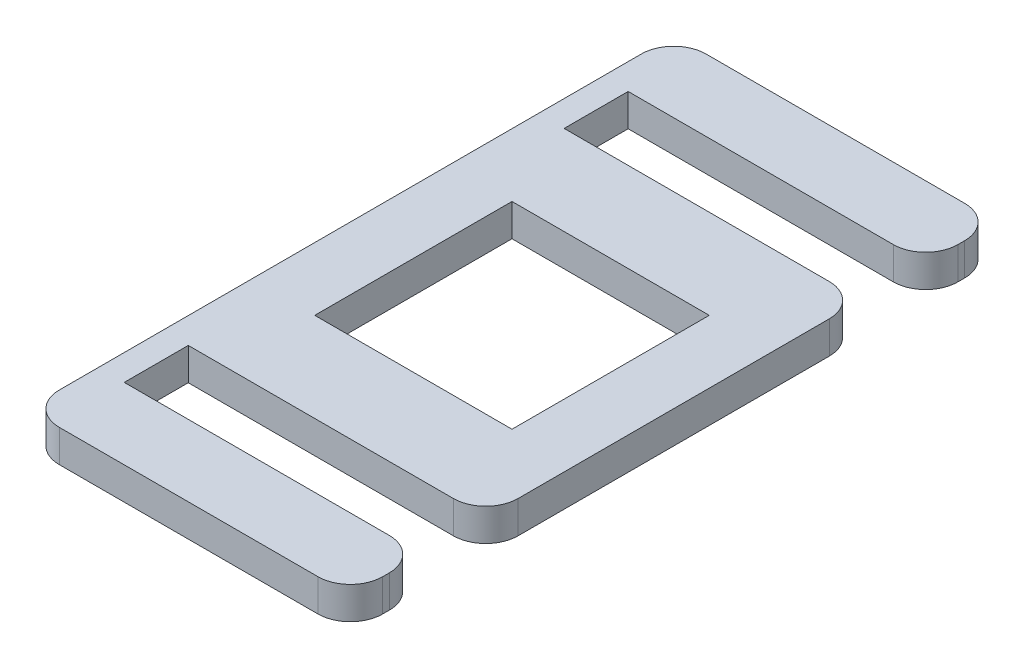
ISO-10303-21;
HEADER;
FILE_DESCRIPTION(('STEP AP214'),'2;1');
FILE_NAME('part.step','',(''),(''),'','','');
FILE_SCHEMA(('AUTOMOTIVE_DESIGN { 1 0 10303 214 1 1 1 1 }'));
ENDSEC;
DATA;
#1=APPLICATION_CONTEXT('core data for automotive mechanical design processes');
#2=APPLICATION_PROTOCOL_DEFINITION('international standard','automotive_design',2000,#1);
#3=PRODUCT_CONTEXT('',#1,'mechanical');
#4=PRODUCT('Part','Part','',(#3));
#5=PRODUCT_RELATED_PRODUCT_CATEGORY('part','',(#4));
#6=PRODUCT_DEFINITION_FORMATION('','',#4);
#7=PRODUCT_DEFINITION_CONTEXT('part definition',#1,'design');
#8=PRODUCT_DEFINITION('design','',#6,#7);
#9=PRODUCT_DEFINITION_SHAPE('','',#8);
#10=(LENGTH_UNIT() NAMED_UNIT(*) SI_UNIT(.MILLI.,.METRE.));
#11=(NAMED_UNIT(*) PLANE_ANGLE_UNIT() SI_UNIT($,.RADIAN.));
#12=(NAMED_UNIT(*) SI_UNIT($,.STERADIAN.) SOLID_ANGLE_UNIT());
#13=UNCERTAINTY_MEASURE_WITH_UNIT(LENGTH_MEASURE(1.E-05),#10,'distance_accuracy_value','');
#14=(GEOMETRIC_REPRESENTATION_CONTEXT(3) GLOBAL_UNCERTAINTY_ASSIGNED_CONTEXT((#13)) GLOBAL_UNIT_ASSIGNED_CONTEXT((#10,
#11,#12)) REPRESENTATION_CONTEXT('',''));
#15=CARTESIAN_POINT('',(0.,0.,0.));
#16=DIRECTION('',(0.,0.,1.));
#17=DIRECTION('',(1.,0.,0.));
#18=AXIS2_PLACEMENT_3D('',#15,#16,#17);
#19=CARTESIAN_POINT('',(25.,5.,50.));
#20=DIRECTION('',(-1.,0.,0.));
#21=DIRECTION('',(0.,0.,1.));
#22=AXIS2_PLACEMENT_3D('',#19,#20,#21);
#23=PLANE('',#22);
#24=DIRECTION('',(0.,0.,-1.));
#25=VECTOR('',#24,1.);
#26=CARTESIAN_POINT('',(25.,5.,50.));
#27=LINE('',#26,#25);
#28=CARTESIAN_POINT('',(25.,5.,24.06));
#29=VERTEX_POINT('',#28);
#30=CARTESIAN_POINT('',(25.,5.,-24.06));
#31=VERTEX_POINT('',#30);
#32=EDGE_CURVE('E268',#29,#31,#27,.T.);
#33=ORIENTED_EDGE('',*,*,#32,.F.);
#34=DIRECTION('',(0.,-1.,0.));
#35=VECTOR('',#34,1.);
#36=CARTESIAN_POINT('',(25.,5.,24.06));
#37=LINE('',#36,#35);
#38=CARTESIAN_POINT('',(25.,0.,24.06));
#39=VERTEX_POINT('',#38);
#40=EDGE_CURVE('E343',#29,#39,#37,.T.);
#41=ORIENTED_EDGE('',*,*,#40,.T.);
#42=DIRECTION('',(0.,0.,-1.));
#43=VECTOR('',#42,1.);
#44=CARTESIAN_POINT('',(25.,0.,50.));
#45=LINE('',#44,#43);
#46=CARTESIAN_POINT('',(25.,0.,-24.06));
#47=VERTEX_POINT('',#46);
#48=EDGE_CURVE('E285',#39,#47,#45,.T.);
#49=ORIENTED_EDGE('',*,*,#48,.T.);
#50=DIRECTION('',(0.,-1.,0.));
#51=VECTOR('',#50,1.);
#52=CARTESIAN_POINT('',(25.,5.,-24.06));
#53=LINE('',#52,#51);
#54=EDGE_CURVE('E341',#47,#31,#53,.F.);
#55=ORIENTED_EDGE('',*,*,#54,.T.);
#56=EDGE_LOOP('',(#33,#41,#49,#55));
#57=FACE_BOUND('',#56,.T.);
#58=ADVANCED_FACE('F33',(#57),#23,.F.);
#59=CARTESIAN_POINT('',(25.,5.,-43.96));
#60=VERTEX_POINT('',#59);
#61=CARTESIAN_POINT('',(25.,5.,-45.));
#62=VERTEX_POINT('',#61);
#63=EDGE_CURVE('E272',#60,#62,#27,.T.);
#64=ORIENTED_EDGE('',*,*,#63,.F.);
#65=DIRECTION('',(0.,1.,0.));
#66=VECTOR('',#65,1.);
#67=CARTESIAN_POINT('',(25.,0.,-43.96));
#68=LINE('',#67,#66);
#69=CARTESIAN_POINT('',(25.,0.,-43.96));
#70=VERTEX_POINT('',#69);
#71=EDGE_CURVE('E356',#60,#70,#68,.F.);
#72=ORIENTED_EDGE('',*,*,#71,.T.);
#73=CARTESIAN_POINT('',(25.,0.,-45.));
#74=VERTEX_POINT('',#73);
#75=EDGE_CURVE('E265',#70,#74,#45,.T.);
#76=ORIENTED_EDGE('',*,*,#75,.T.);
#77=DIRECTION('',(0.,-1.,0.));
#78=VECTOR('',#77,1.);
#79=CARTESIAN_POINT('',(25.,5.,-45.));
#80=LINE('',#79,#78);
#81=EDGE_CURVE('E354',#74,#62,#80,.F.);
#82=ORIENTED_EDGE('',*,*,#81,.T.);
#83=EDGE_LOOP('',(#64,#72,#76,#82));
#84=FACE_BOUND('',#83,.T.);
#85=ADVANCED_FACE('F421',(#84),#23,.F.);
#86=CARTESIAN_POINT('',(0.,5.,0.));
#87=DIRECTION('',(0.,-1.,0.));
#88=DIRECTION('',(0.,0.,-1.));
#89=AXIS2_PLACEMENT_3D('',#86,#87,#88);
#90=PLANE('',#89);
#91=DIRECTION('',(-1.,0.,0.));
#92=VECTOR('',#91,1.);
#93=CARTESIAN_POINT('',(-15.25,5.,-15.25));
#94=LINE('',#93,#92);
#95=CARTESIAN_POINT('',(15.25,5.,-15.25));
#96=VERTEX_POINT('',#95);
#97=CARTESIAN_POINT('',(-15.25,5.,-15.25));
#98=VERTEX_POINT('',#97);
#99=EDGE_CURVE('E220',#96,#98,#94,.T.);
#100=ORIENTED_EDGE('',*,*,#99,.F.);
#101=DIRECTION('',(0.,0.,-1.));
#102=VECTOR('',#101,1.);
#103=CARTESIAN_POINT('',(15.25,5.,-15.25));
#104=LINE('',#103,#102);
#105=CARTESIAN_POINT('',(15.25,5.,15.25));
#106=VERTEX_POINT('',#105);
#107=EDGE_CURVE('E48',#106,#96,#104,.T.);
#108=ORIENTED_EDGE('',*,*,#107,.F.);
#109=DIRECTION('',(1.,0.,0.));
#110=VECTOR('',#109,1.);
#111=CARTESIAN_POINT('',(-15.25,5.,15.25));
#112=LINE('',#111,#110);
#113=CARTESIAN_POINT('',(-15.25,5.,15.25));
#114=VERTEX_POINT('',#113);
#115=EDGE_CURVE('E211',#114,#106,#112,.T.);
#116=ORIENTED_EDGE('',*,*,#115,.F.);
#117=DIRECTION('',(0.,0.,1.));
#118=VECTOR('',#117,1.);
#119=CARTESIAN_POINT('',(-15.25,5.,-15.25));
#120=LINE('',#119,#118);
#121=EDGE_CURVE('E214',#98,#114,#120,.T.);
#122=ORIENTED_EDGE('',*,*,#121,.F.);
#123=EDGE_LOOP('',(#100,#108,#116,#122));
#124=FACE_BOUND('',#123,.T.);
#125=CARTESIAN_POINT('',(25.,5.,45.));
#126=VERTEX_POINT('',#125);
#127=CARTESIAN_POINT('',(25.,5.,43.96));
#128=VERTEX_POINT('',#127);
#129=EDGE_CURVE('E271',#126,#128,#27,.T.);
#130=ORIENTED_EDGE('',*,*,#129,.T.);
#131=CARTESIAN_POINT('',(20.,5.,43.96));
#132=DIRECTION('',(0.,-1.,0.));
#133=DIRECTION('',(0.,0.,-1.));
#134=AXIS2_PLACEMENT_3D('',#131,#132,#133);
#135=CIRCLE('',#134,5.);
#136=CARTESIAN_POINT('',(20.,5.,38.96));
#137=VERTEX_POINT('',#136);
#138=EDGE_CURVE('E321',#128,#137,#135,.F.);
#139=ORIENTED_EDGE('',*,*,#138,.T.);
#140=DIRECTION('',(1.,0.,0.));
#141=VECTOR('',#140,1.);
#142=CARTESIAN_POINT('',(-21.,5.,38.96));
#143=LINE('',#142,#141);
#144=CARTESIAN_POINT('',(-21.,5.,38.96));
#145=VERTEX_POINT('',#144);
#146=EDGE_CURVE('E253',#145,#137,#143,.T.);
#147=ORIENTED_EDGE('',*,*,#146,.F.);
#148=DIRECTION('',(0.,0.,1.));
#149=VECTOR('',#148,1.);
#150=CARTESIAN_POINT('',(-21.,5.,38.96));
#151=LINE('',#150,#149);
#152=CARTESIAN_POINT('',(-21.,5.,29.06));
#153=VERTEX_POINT('',#152);
#154=EDGE_CURVE('E258',#153,#145,#151,.T.);
#155=ORIENTED_EDGE('',*,*,#154,.F.);
#156=DIRECTION('',(-1.,0.,0.));
#157=VECTOR('',#156,1.);
#158=CARTESIAN_POINT('',(-21.,5.,29.06));
#159=LINE('',#158,#157);
#160=CARTESIAN_POINT('',(20.,5.,29.06));
#161=VERTEX_POINT('',#160);
#162=EDGE_CURVE('E247',#161,#153,#159,.T.);
#163=ORIENTED_EDGE('',*,*,#162,.F.);
#164=CARTESIAN_POINT('',(20.,5.,24.06));
#165=DIRECTION('',(0.,-1.,0.));
#166=DIRECTION('',(0.,0.,-1.));
#167=AXIS2_PLACEMENT_3D('',#164,#165,#166);
#168=CIRCLE('',#167,5.);
#169=EDGE_CURVE('E319',#161,#29,#168,.F.);
#170=ORIENTED_EDGE('',*,*,#169,.T.);
#171=ORIENTED_EDGE('',*,*,#32,.T.);
#172=CARTESIAN_POINT('',(20.,5.,-24.06));
#173=DIRECTION('',(0.,-1.,0.));
#174=DIRECTION('',(0.,0.,-1.));
#175=AXIS2_PLACEMENT_3D('',#172,#173,#174);
#176=CIRCLE('',#175,5.);
#177=CARTESIAN_POINT('',(20.,5.,-29.06));
#178=VERTEX_POINT('',#177);
#179=EDGE_CURVE('E317',#31,#178,#176,.F.);
#180=ORIENTED_EDGE('',*,*,#179,.T.);
#181=DIRECTION('',(-1.,0.,0.));
#182=VECTOR('',#181,1.);
#183=CARTESIAN_POINT('',(-21.,5.,-29.06));
#184=LINE('',#183,#182);
#185=CARTESIAN_POINT('',(-21.,5.,-29.06));
#186=VERTEX_POINT('',#185);
#187=EDGE_CURVE('E234',#178,#186,#184,.T.);
#188=ORIENTED_EDGE('',*,*,#187,.T.);
#189=DIRECTION('',(0.,0.,-1.));
#190=VECTOR('',#189,1.);
#191=CARTESIAN_POINT('',(-21.,5.,-38.96));
#192=LINE('',#191,#190);
#193=CARTESIAN_POINT('',(-21.,5.,-38.96));
#194=VERTEX_POINT('',#193);
#195=EDGE_CURVE('E240',#186,#194,#192,.T.);
#196=ORIENTED_EDGE('',*,*,#195,.T.);
#197=DIRECTION('',(1.,0.,0.));
#198=VECTOR('',#197,1.);
#199=CARTESIAN_POINT('',(-21.,5.,-38.96));
#200=LINE('',#199,#198);
#201=CARTESIAN_POINT('',(20.,5.,-38.96));
#202=VERTEX_POINT('',#201);
#203=EDGE_CURVE('E226',#194,#202,#200,.T.);
#204=ORIENTED_EDGE('',*,*,#203,.T.);
#205=CARTESIAN_POINT('',(20.,5.,-43.96));
#206=DIRECTION('',(0.,-1.,0.));
#207=DIRECTION('',(0.,0.,-1.));
#208=AXIS2_PLACEMENT_3D('',#205,#206,#207);
#209=CIRCLE('',#208,5.);
#210=EDGE_CURVE('E315',#202,#60,#209,.F.);
#211=ORIENTED_EDGE('',*,*,#210,.T.);
#212=ORIENTED_EDGE('',*,*,#63,.T.);
#213=CARTESIAN_POINT('',(20.,5.,-45.));
#214=DIRECTION('',(0.,-1.,0.));
#215=DIRECTION('',(0.,0.,-1.));
#216=AXIS2_PLACEMENT_3D('',#213,#214,#215);
#217=CIRCLE('',#216,5.);
#218=CARTESIAN_POINT('',(20.,5.,-50.));
#219=VERTEX_POINT('',#218);
#220=EDGE_CURVE('E313',#62,#219,#217,.F.);
#221=ORIENTED_EDGE('',*,*,#220,.T.);
#222=DIRECTION('',(-1.,0.,0.));
#223=VECTOR('',#222,1.);
#224=CARTESIAN_POINT('',(-25.,5.,-50.));
#225=LINE('',#224,#223);
#226=CARTESIAN_POINT('',(-20.,5.,-50.));
#227=VERTEX_POINT('',#226);
#228=EDGE_CURVE('E273',#219,#227,#225,.T.);
#229=ORIENTED_EDGE('',*,*,#228,.T.);
#230=CARTESIAN_POINT('',(-20.,5.,-45.));
#231=DIRECTION('',(0.,-1.,0.));
#232=DIRECTION('',(0.,0.,-1.));
#233=AXIS2_PLACEMENT_3D('',#230,#231,#232);
#234=CIRCLE('',#233,5.);
#235=CARTESIAN_POINT('',(-25.,5.,-45.));
#236=VERTEX_POINT('',#235);
#237=EDGE_CURVE('E311',#227,#236,#234,.F.);
#238=ORIENTED_EDGE('',*,*,#237,.T.);
#239=DIRECTION('',(0.,0.,1.));
#240=VECTOR('',#239,1.);
#241=CARTESIAN_POINT('',(-25.,5.,50.));
#242=LINE('',#241,#240);
#243=CARTESIAN_POINT('',(-25.,5.,45.));
#244=VERTEX_POINT('',#243);
#245=EDGE_CURVE('E276',#236,#244,#242,.T.);
#246=ORIENTED_EDGE('',*,*,#245,.T.);
#247=CARTESIAN_POINT('',(-20.,5.,45.));
#248=DIRECTION('',(0.,-1.,0.));
#249=DIRECTION('',(0.,0.,-1.));
#250=AXIS2_PLACEMENT_3D('',#247,#248,#249);
#251=CIRCLE('',#250,5.);
#252=CARTESIAN_POINT('',(-20.,5.,50.));
#253=VERTEX_POINT('',#252);
#254=EDGE_CURVE('E307',#244,#253,#251,.F.);
#255=ORIENTED_EDGE('',*,*,#254,.T.);
#256=DIRECTION('',(1.,0.,0.));
#257=VECTOR('',#256,1.);
#258=CARTESIAN_POINT('',(-25.,5.,50.));
#259=LINE('',#258,#257);
#260=CARTESIAN_POINT('',(20.,5.,50.));
#261=VERTEX_POINT('',#260);
#262=EDGE_CURVE('E279',#253,#261,#259,.T.);
#263=ORIENTED_EDGE('',*,*,#262,.T.);
#264=CARTESIAN_POINT('',(20.,5.,45.));
#265=DIRECTION('',(0.,-1.,0.));
#266=DIRECTION('',(0.,0.,-1.));
#267=AXIS2_PLACEMENT_3D('',#264,#265,#266);
#268=CIRCLE('',#267,5.);
#269=EDGE_CURVE('E309',#261,#126,#268,.F.);
#270=ORIENTED_EDGE('',*,*,#269,.T.);
#271=EDGE_LOOP('',(#130,#139,#147,#155,#163,#170,#171,#180,#188,#196,#204,#211,#212,#221,#229,
#238,#246,#255,#263,#270));
#272=FACE_BOUND('',#271,.T.);
#273=ADVANCED_FACE('F392',(#124,#272),#90,.F.);
#274=CARTESIAN_POINT('',(0.,0.,0.));
#275=DIRECTION('',(0.,-1.,0.));
#276=DIRECTION('',(0.,0.,-1.));
#277=AXIS2_PLACEMENT_3D('',#274,#275,#276);
#278=PLANE('',#277);
#279=DIRECTION('',(0.,0.,-1.));
#280=VECTOR('',#279,1.);
#281=CARTESIAN_POINT('',(15.25,0.,-15.25));
#282=LINE('',#281,#280);
#283=CARTESIAN_POINT('',(15.25,0.,15.25));
#284=VERTEX_POINT('',#283);
#285=CARTESIAN_POINT('',(15.25,0.,-15.25));
#286=VERTEX_POINT('',#285);
#287=EDGE_CURVE('E195',#284,#286,#282,.T.);
#288=ORIENTED_EDGE('',*,*,#287,.T.);
#289=DIRECTION('',(-1.,0.,0.));
#290=VECTOR('',#289,1.);
#291=CARTESIAN_POINT('',(-15.25,0.,-15.25));
#292=LINE('',#291,#290);
#293=CARTESIAN_POINT('',(-15.25,0.,-15.25));
#294=VERTEX_POINT('',#293);
#295=EDGE_CURVE('E204',#286,#294,#292,.T.);
#296=ORIENTED_EDGE('',*,*,#295,.T.);
#297=DIRECTION('',(0.,0.,1.));
#298=VECTOR('',#297,1.);
#299=CARTESIAN_POINT('',(-15.25,0.,-15.25));
#300=LINE('',#299,#298);
#301=CARTESIAN_POINT('',(-15.25,0.,15.25));
#302=VERTEX_POINT('',#301);
#303=EDGE_CURVE('E56',#294,#302,#300,.T.);
#304=ORIENTED_EDGE('',*,*,#303,.T.);
#305=DIRECTION('',(1.,0.,0.));
#306=VECTOR('',#305,1.);
#307=CARTESIAN_POINT('',(-15.25,0.,15.25));
#308=LINE('',#307,#306);
#309=EDGE_CURVE('E201',#302,#284,#308,.T.);
#310=ORIENTED_EDGE('',*,*,#309,.T.);
#311=EDGE_LOOP('',(#288,#296,#304,#310));
#312=FACE_BOUND('',#311,.T.);
#313=DIRECTION('',(1.,0.,0.));
#314=VECTOR('',#313,1.);
#315=CARTESIAN_POINT('',(-21.,0.,38.96));
#316=LINE('',#315,#314);
#317=CARTESIAN_POINT('',(-21.,0.,38.96));
#318=VERTEX_POINT('',#317);
#319=CARTESIAN_POINT('',(20.,0.,38.96));
#320=VERTEX_POINT('',#319);
#321=EDGE_CURVE('E252',#318,#320,#316,.T.);
#322=ORIENTED_EDGE('',*,*,#321,.T.);
#323=CARTESIAN_POINT('',(20.,0.,43.96));
#324=DIRECTION('',(0.,-1.,0.));
#325=DIRECTION('',(0.,0.,-1.));
#326=AXIS2_PLACEMENT_3D('',#323,#324,#325);
#327=CIRCLE('',#326,5.);
#328=CARTESIAN_POINT('',(25.,0.,43.96));
#329=VERTEX_POINT('',#328);
#330=EDGE_CURVE('E339',#320,#329,#327,.T.);
#331=ORIENTED_EDGE('',*,*,#330,.T.);
#332=CARTESIAN_POINT('',(25.,0.,45.));
#333=VERTEX_POINT('',#332);
#334=EDGE_CURVE('E286',#333,#329,#45,.T.);
#335=ORIENTED_EDGE('',*,*,#334,.F.);
#336=CARTESIAN_POINT('',(20.,0.,45.));
#337=DIRECTION('',(0.,-1.,0.));
#338=DIRECTION('',(0.,0.,-1.));
#339=AXIS2_PLACEMENT_3D('',#336,#337,#338);
#340=CIRCLE('',#339,5.);
#341=CARTESIAN_POINT('',(20.,0.,50.));
#342=VERTEX_POINT('',#341);
#343=EDGE_CURVE('E327',#333,#342,#340,.T.);
#344=ORIENTED_EDGE('',*,*,#343,.T.);
#345=DIRECTION('',(1.,0.,0.));
#346=VECTOR('',#345,1.);
#347=CARTESIAN_POINT('',(-25.,0.,50.));
#348=LINE('',#347,#346);
#349=CARTESIAN_POINT('',(-20.,0.,50.));
#350=VERTEX_POINT('',#349);
#351=EDGE_CURVE('E293',#350,#342,#348,.T.);
#352=ORIENTED_EDGE('',*,*,#351,.F.);
#353=CARTESIAN_POINT('',(-20.,0.,45.));
#354=DIRECTION('',(0.,-1.,0.));
#355=DIRECTION('',(0.,0.,-1.));
#356=AXIS2_PLACEMENT_3D('',#353,#354,#355);
#357=CIRCLE('',#356,5.);
#358=CARTESIAN_POINT('',(-25.,0.,45.));
#359=VERTEX_POINT('',#358);
#360=EDGE_CURVE('E325',#350,#359,#357,.T.);
#361=ORIENTED_EDGE('',*,*,#360,.T.);
#362=DIRECTION('',(0.,0.,1.));
#363=VECTOR('',#362,1.);
#364=CARTESIAN_POINT('',(-25.,0.,50.));
#365=LINE('',#364,#363);
#366=CARTESIAN_POINT('',(-25.,0.,-45.));
#367=VERTEX_POINT('',#366);
#368=EDGE_CURVE('E290',#367,#359,#365,.T.);
#369=ORIENTED_EDGE('',*,*,#368,.F.);
#370=CARTESIAN_POINT('',(-20.,0.,-45.));
#371=DIRECTION('',(0.,-1.,0.));
#372=DIRECTION('',(0.,0.,-1.));
#373=AXIS2_PLACEMENT_3D('',#370,#371,#372);
#374=CIRCLE('',#373,5.);
#375=CARTESIAN_POINT('',(-20.,0.,-50.));
#376=VERTEX_POINT('',#375);
#377=EDGE_CURVE('E329',#367,#376,#374,.T.);
#378=ORIENTED_EDGE('',*,*,#377,.T.);
#379=DIRECTION('',(-1.,0.,0.));
#380=VECTOR('',#379,1.);
#381=CARTESIAN_POINT('',(-25.,0.,-50.));
#382=LINE('',#381,#380);
#383=CARTESIAN_POINT('',(20.,0.,-50.));
#384=VERTEX_POINT('',#383);
#385=EDGE_CURVE('E287',#384,#376,#382,.T.);
#386=ORIENTED_EDGE('',*,*,#385,.F.);
#387=CARTESIAN_POINT('',(20.,0.,-45.));
#388=DIRECTION('',(0.,-1.,0.));
#389=DIRECTION('',(0.,0.,-1.));
#390=AXIS2_PLACEMENT_3D('',#387,#388,#389);
#391=CIRCLE('',#390,5.);
#392=EDGE_CURVE('E331',#384,#74,#391,.T.);
#393=ORIENTED_EDGE('',*,*,#392,.T.);
#394=ORIENTED_EDGE('',*,*,#75,.F.);
#395=CARTESIAN_POINT('',(20.,0.,-43.96));
#396=DIRECTION('',(0.,-1.,0.));
#397=DIRECTION('',(0.,0.,-1.));
#398=AXIS2_PLACEMENT_3D('',#395,#396,#397);
#399=CIRCLE('',#398,5.);
#400=CARTESIAN_POINT('',(20.,0.,-38.96));
#401=VERTEX_POINT('',#400);
#402=EDGE_CURVE('E333',#70,#401,#399,.T.);
#403=ORIENTED_EDGE('',*,*,#402,.T.);
#404=DIRECTION('',(1.,0.,0.));
#405=VECTOR('',#404,1.);
#406=CARTESIAN_POINT('',(-21.,0.,-38.96));
#407=LINE('',#406,#405);
#408=CARTESIAN_POINT('',(-21.,0.,-38.96));
#409=VERTEX_POINT('',#408);
#410=EDGE_CURVE('E230',#409,#401,#407,.T.);
#411=ORIENTED_EDGE('',*,*,#410,.F.);
#412=DIRECTION('',(0.,0.,-1.));
#413=VECTOR('',#412,1.);
#414=CARTESIAN_POINT('',(-21.,0.,-38.96));
#415=LINE('',#414,#413);
#416=CARTESIAN_POINT('',(-21.,0.,-29.06));
#417=VERTEX_POINT('',#416);
#418=EDGE_CURVE('E233',#417,#409,#415,.T.);
#419=ORIENTED_EDGE('',*,*,#418,.F.);
#420=DIRECTION('',(1.,0.,0.));
#421=VECTOR('',#420,1.);
#422=CARTESIAN_POINT('',(0.,0.,-29.06));
#423=LINE('',#422,#421);
#424=CARTESIAN_POINT('',(20.,0.,-29.06));
#425=VERTEX_POINT('',#424);
#426=EDGE_CURVE('E298',#417,#425,#423,.T.);
#427=ORIENTED_EDGE('',*,*,#426,.T.);
#428=CARTESIAN_POINT('',(20.,0.,-24.06));
#429=DIRECTION('',(0.,-1.,0.));
#430=DIRECTION('',(0.,0.,-1.));
#431=AXIS2_PLACEMENT_3D('',#428,#429,#430);
#432=CIRCLE('',#431,5.);
#433=EDGE_CURVE('E335',#425,#47,#432,.T.);
#434=ORIENTED_EDGE('',*,*,#433,.T.);
#435=ORIENTED_EDGE('',*,*,#48,.F.);
#436=CARTESIAN_POINT('',(20.,0.,24.06));
#437=DIRECTION('',(0.,-1.,0.));
#438=DIRECTION('',(0.,0.,-1.));
#439=AXIS2_PLACEMENT_3D('',#436,#437,#438);
#440=CIRCLE('',#439,5.);
#441=CARTESIAN_POINT('',(20.,0.,29.06));
#442=VERTEX_POINT('',#441);
#443=EDGE_CURVE('E337',#39,#442,#440,.T.);
#444=ORIENTED_EDGE('',*,*,#443,.T.);
#445=DIRECTION('',(1.,0.,0.));
#446=VECTOR('',#445,1.);
#447=CARTESIAN_POINT('',(0.,0.,29.06));
#448=LINE('',#447,#446);
#449=CARTESIAN_POINT('',(-21.,0.,29.06));
#450=VERTEX_POINT('',#449);
#451=EDGE_CURVE('E282',#450,#442,#448,.T.);
#452=ORIENTED_EDGE('',*,*,#451,.F.);
#453=DIRECTION('',(0.,0.,1.));
#454=VECTOR('',#453,1.);
#455=CARTESIAN_POINT('',(-21.,0.,38.96));
#456=LINE('',#455,#454);
#457=EDGE_CURVE('E249',#450,#318,#456,.T.);
#458=ORIENTED_EDGE('',*,*,#457,.T.);
#459=EDGE_LOOP('',(#322,#331,#335,#344,#352,#361,#369,#378,#386,#393,#394,#403,#411,#419,#427,
#434,#435,#444,#452,#458));
#460=FACE_BOUND('',#459,.T.);
#461=ADVANCED_FACE('F208',(#312,#460),#278,.T.);
#462=ORIENTED_EDGE('',*,*,#334,.T.);
#463=DIRECTION('',(0.,1.,0.));
#464=VECTOR('',#463,1.);
#465=CARTESIAN_POINT('',(25.,5.,43.96));
#466=LINE('',#465,#464);
#467=EDGE_CURVE('E304',#329,#128,#466,.T.);
#468=ORIENTED_EDGE('',*,*,#467,.T.);
#469=ORIENTED_EDGE('',*,*,#129,.F.);
#470=DIRECTION('',(0.,-1.,0.));
#471=VECTOR('',#470,1.);
#472=CARTESIAN_POINT('',(25.,5.,45.));
#473=LINE('',#472,#471);
#474=EDGE_CURVE('E301',#126,#333,#473,.T.);
#475=ORIENTED_EDGE('',*,*,#474,.T.);
#476=EDGE_LOOP('',(#462,#468,#469,#475));
#477=FACE_BOUND('',#476,.T.);
#478=ADVANCED_FACE('F385',(#477),#23,.F.);
#479=CARTESIAN_POINT('',(-25.,5.,-50.));
#480=DIRECTION('',(0.,0.,1.));
#481=DIRECTION('',(1.,0.,0.));
#482=AXIS2_PLACEMENT_3D('',#479,#480,#481);
#483=PLANE('',#482);
#484=ORIENTED_EDGE('',*,*,#228,.F.);
#485=DIRECTION('',(0.,-1.,0.));
#486=VECTOR('',#485,1.);
#487=CARTESIAN_POINT('',(20.,5.,-50.));
#488=LINE('',#487,#486);
#489=EDGE_CURVE('E360',#219,#384,#488,.T.);
#490=ORIENTED_EDGE('',*,*,#489,.T.);
#491=ORIENTED_EDGE('',*,*,#385,.T.);
#492=DIRECTION('',(0.,-1.,0.));
#493=VECTOR('',#492,1.);
#494=CARTESIAN_POINT('',(-20.,5.,-50.));
#495=LINE('',#494,#493);
#496=EDGE_CURVE('E358',#376,#227,#495,.F.);
#497=ORIENTED_EDGE('',*,*,#496,.T.);
#498=EDGE_LOOP('',(#484,#490,#491,#497));
#499=FACE_BOUND('',#498,.T.);
#500=ADVANCED_FACE('F402',(#499),#483,.F.);
#501=CARTESIAN_POINT('',(-25.,5.,50.));
#502=DIRECTION('',(1.,0.,0.));
#503=DIRECTION('',(0.,0.,-1.));
#504=AXIS2_PLACEMENT_3D('',#501,#502,#503);
#505=PLANE('',#504);
#506=ORIENTED_EDGE('',*,*,#245,.F.);
#507=DIRECTION('',(0.,-1.,0.));
#508=VECTOR('',#507,1.);
#509=CARTESIAN_POINT('',(-25.,5.,-45.));
#510=LINE('',#509,#508);
#511=EDGE_CURVE('E365',#236,#367,#510,.T.);
#512=ORIENTED_EDGE('',*,*,#511,.T.);
#513=ORIENTED_EDGE('',*,*,#368,.T.);
#514=DIRECTION('',(0.,-1.,0.));
#515=VECTOR('',#514,1.);
#516=CARTESIAN_POINT('',(-25.,5.,45.));
#517=LINE('',#516,#515);
#518=EDGE_CURVE('E363',#359,#244,#517,.F.);
#519=ORIENTED_EDGE('',*,*,#518,.T.);
#520=EDGE_LOOP('',(#506,#512,#513,#519));
#521=FACE_BOUND('',#520,.T.);
#522=ADVANCED_FACE('F411',(#521),#505,.F.);
#523=CARTESIAN_POINT('',(-25.,5.,50.));
#524=DIRECTION('',(0.,0.,-1.));
#525=DIRECTION('',(-1.,0.,0.));
#526=AXIS2_PLACEMENT_3D('',#523,#524,#525);
#527=PLANE('',#526);
#528=ORIENTED_EDGE('',*,*,#351,.T.);
#529=DIRECTION('',(0.,-1.,0.));
#530=VECTOR('',#529,1.);
#531=CARTESIAN_POINT('',(20.,5.,50.));
#532=LINE('',#531,#530);
#533=EDGE_CURVE('E11',#342,#261,#532,.F.);
#534=ORIENTED_EDGE('',*,*,#533,.T.);
#535=ORIENTED_EDGE('',*,*,#262,.F.);
#536=DIRECTION('',(0.,-1.,0.));
#537=VECTOR('',#536,1.);
#538=CARTESIAN_POINT('',(-20.,5.,50.));
#539=LINE('',#538,#537);
#540=EDGE_CURVE('E41',#253,#350,#539,.T.);
#541=ORIENTED_EDGE('',*,*,#540,.T.);
#542=EDGE_LOOP('',(#528,#534,#535,#541));
#543=FACE_BOUND('',#542,.T.);
#544=ADVANCED_FACE('F372',(#543),#527,.F.);
#545=CARTESIAN_POINT('',(-21.,0.,38.96));
#546=DIRECTION('',(0.,0.,1.));
#547=DIRECTION('',(1.,0.,0.));
#548=AXIS2_PLACEMENT_3D('',#545,#546,#547);
#549=PLANE('',#548);
#550=ORIENTED_EDGE('',*,*,#146,.T.);
#551=DIRECTION('',(0.,1.,0.));
#552=VECTOR('',#551,1.);
#553=CARTESIAN_POINT('',(20.,0.,38.96));
#554=LINE('',#553,#552);
#555=EDGE_CURVE('E323',#137,#320,#554,.F.);
#556=ORIENTED_EDGE('',*,*,#555,.T.);
#557=ORIENTED_EDGE('',*,*,#321,.F.);
#558=DIRECTION('',(0.,1.,0.));
#559=VECTOR('',#558,1.);
#560=CARTESIAN_POINT('',(-21.,0.,38.96));
#561=LINE('',#560,#559);
#562=EDGE_CURVE('E263',#318,#145,#561,.T.);
#563=ORIENTED_EDGE('',*,*,#562,.T.);
#564=EDGE_LOOP('',(#550,#556,#557,#563));
#565=FACE_BOUND('',#564,.T.);
#566=ADVANCED_FACE('F445',(#565),#549,.F.);
#567=CARTESIAN_POINT('',(-21.,0.,29.06));
#568=DIRECTION('',(0.,0.,-1.));
#569=DIRECTION('',(-1.,0.,0.));
#570=AXIS2_PLACEMENT_3D('',#567,#568,#569);
#571=PLANE('',#570);
#572=ORIENTED_EDGE('',*,*,#451,.T.);
#573=DIRECTION('',(0.,-1.,0.));
#574=VECTOR('',#573,1.);
#575=CARTESIAN_POINT('',(20.,0.,29.06));
#576=LINE('',#575,#574);
#577=EDGE_CURVE('E346',#442,#161,#576,.F.);
#578=ORIENTED_EDGE('',*,*,#577,.T.);
#579=ORIENTED_EDGE('',*,*,#162,.T.);
#580=DIRECTION('',(0.,1.,0.));
#581=VECTOR('',#580,1.);
#582=CARTESIAN_POINT('',(-21.,0.,29.06));
#583=LINE('',#582,#581);
#584=EDGE_CURVE('E256',#450,#153,#583,.T.);
#585=ORIENTED_EDGE('',*,*,#584,.F.);
#586=EDGE_LOOP('',(#572,#578,#579,#585));
#587=FACE_BOUND('',#586,.T.);
#588=ADVANCED_FACE('F461',(#587),#571,.F.);
#589=CARTESIAN_POINT('',(-21.,0.,38.96));
#590=DIRECTION('',(-1.,0.,0.));
#591=DIRECTION('',(0.,0.,1.));
#592=AXIS2_PLACEMENT_3D('',#589,#590,#591);
#593=PLANE('',#592);
#594=ORIENTED_EDGE('',*,*,#154,.T.);
#595=ORIENTED_EDGE('',*,*,#562,.F.);
#596=ORIENTED_EDGE('',*,*,#457,.F.);
#597=ORIENTED_EDGE('',*,*,#584,.T.);
#598=EDGE_LOOP('',(#594,#595,#596,#597));
#599=FACE_BOUND('',#598,.T.);
#600=ADVANCED_FACE('F469',(#599),#593,.F.);
#601=CARTESIAN_POINT('',(-21.,0.,-29.06));
#602=DIRECTION('',(0.,0.,-1.));
#603=DIRECTION('',(-1.,0.,0.));
#604=AXIS2_PLACEMENT_3D('',#601,#602,#603);
#605=PLANE('',#604);
#606=ORIENTED_EDGE('',*,*,#187,.F.);
#607=DIRECTION('',(0.,-1.,0.));
#608=VECTOR('',#607,1.);
#609=CARTESIAN_POINT('',(20.,0.,-29.06));
#610=LINE('',#609,#608);
#611=EDGE_CURVE('E348',#178,#425,#610,.T.);
#612=ORIENTED_EDGE('',*,*,#611,.T.);
#613=ORIENTED_EDGE('',*,*,#426,.F.);
#614=DIRECTION('',(0.,1.,0.));
#615=VECTOR('',#614,1.);
#616=CARTESIAN_POINT('',(-21.,0.,-29.06));
#617=LINE('',#616,#615);
#618=EDGE_CURVE('E244',#417,#186,#617,.T.);
#619=ORIENTED_EDGE('',*,*,#618,.T.);
#620=EDGE_LOOP('',(#606,#612,#613,#619));
#621=FACE_BOUND('',#620,.T.);
#622=ADVANCED_FACE('F477',(#621),#605,.T.);
#623=CARTESIAN_POINT('',(-21.,0.,-38.96));
#624=DIRECTION('',(0.,0.,1.));
#625=DIRECTION('',(1.,0.,0.));
#626=AXIS2_PLACEMENT_3D('',#623,#624,#625);
#627=PLANE('',#626);
#628=ORIENTED_EDGE('',*,*,#410,.T.);
#629=DIRECTION('',(0.,1.,0.));
#630=VECTOR('',#629,1.);
#631=CARTESIAN_POINT('',(20.,5.,-38.96));
#632=LINE('',#631,#630);
#633=EDGE_CURVE('E351',#401,#202,#632,.T.);
#634=ORIENTED_EDGE('',*,*,#633,.T.);
#635=ORIENTED_EDGE('',*,*,#203,.F.);
#636=DIRECTION('',(0.,1.,0.));
#637=VECTOR('',#636,1.);
#638=CARTESIAN_POINT('',(-21.,0.,-38.96));
#639=LINE('',#638,#637);
#640=EDGE_CURVE('E237',#409,#194,#639,.T.);
#641=ORIENTED_EDGE('',*,*,#640,.F.);
#642=EDGE_LOOP('',(#628,#634,#635,#641));
#643=FACE_BOUND('',#642,.T.);
#644=ADVANCED_FACE('F485',(#643),#627,.T.);
#645=CARTESIAN_POINT('',(-21.,0.,-38.96));
#646=DIRECTION('',(1.,0.,0.));
#647=DIRECTION('',(0.,0.,-1.));
#648=AXIS2_PLACEMENT_3D('',#645,#646,#647);
#649=PLANE('',#648);
#650=ORIENTED_EDGE('',*,*,#195,.F.);
#651=ORIENTED_EDGE('',*,*,#618,.F.);
#652=ORIENTED_EDGE('',*,*,#418,.T.);
#653=ORIENTED_EDGE('',*,*,#640,.T.);
#654=EDGE_LOOP('',(#650,#651,#652,#653));
#655=FACE_BOUND('',#654,.T.);
#656=ADVANCED_FACE('F493',(#655),#649,.T.);
#657=CARTESIAN_POINT('',(20.,5.,43.96));
#658=DIRECTION('',(0.,1.,0.));
#659=DIRECTION('',(0.,0.,1.));
#660=AXIS2_PLACEMENT_3D('',#657,#658,#659);
#661=CYLINDRICAL_SURFACE('',#660,5.);
#662=ORIENTED_EDGE('',*,*,#330,.F.);
#663=ORIENTED_EDGE('',*,*,#555,.F.);
#664=ORIENTED_EDGE('',*,*,#138,.F.);
#665=ORIENTED_EDGE('',*,*,#467,.F.);
#666=EDGE_LOOP('',(#662,#663,#664,#665));
#667=FACE_BOUND('',#666,.T.);
#668=ADVANCED_FACE('F501',(#667),#661,.T.);
#669=CARTESIAN_POINT('',(20.,5.,24.06));
#670=DIRECTION('',(0.,-1.,0.));
#671=DIRECTION('',(0.,0.,-1.));
#672=AXIS2_PLACEMENT_3D('',#669,#670,#671);
#673=CYLINDRICAL_SURFACE('',#672,5.);
#674=ORIENTED_EDGE('',*,*,#169,.F.);
#675=ORIENTED_EDGE('',*,*,#577,.F.);
#676=ORIENTED_EDGE('',*,*,#443,.F.);
#677=ORIENTED_EDGE('',*,*,#40,.F.);
#678=EDGE_LOOP('',(#674,#675,#676,#677));
#679=FACE_BOUND('',#678,.T.);
#680=ADVANCED_FACE('F508',(#679),#673,.T.);
#681=CARTESIAN_POINT('',(20.,0.,-24.06));
#682=DIRECTION('',(0.,1.,0.));
#683=DIRECTION('',(0.,0.,1.));
#684=AXIS2_PLACEMENT_3D('',#681,#682,#683);
#685=CYLINDRICAL_SURFACE('',#684,5.);
#686=ORIENTED_EDGE('',*,*,#179,.F.);
#687=ORIENTED_EDGE('',*,*,#54,.F.);
#688=ORIENTED_EDGE('',*,*,#433,.F.);
#689=ORIENTED_EDGE('',*,*,#611,.F.);
#690=EDGE_LOOP('',(#686,#687,#688,#689));
#691=FACE_BOUND('',#690,.T.);
#692=ADVANCED_FACE('F515',(#691),#685,.T.);
#693=CARTESIAN_POINT('',(20.,0.,-43.96));
#694=DIRECTION('',(0.,-1.,0.));
#695=DIRECTION('',(0.,0.,-1.));
#696=AXIS2_PLACEMENT_3D('',#693,#694,#695);
#697=CYLINDRICAL_SURFACE('',#696,5.);
#698=ORIENTED_EDGE('',*,*,#402,.F.);
#699=ORIENTED_EDGE('',*,*,#71,.F.);
#700=ORIENTED_EDGE('',*,*,#210,.F.);
#701=ORIENTED_EDGE('',*,*,#633,.F.);
#702=EDGE_LOOP('',(#698,#699,#700,#701));
#703=FACE_BOUND('',#702,.T.);
#704=ADVANCED_FACE('F523',(#703),#697,.T.);
#705=CARTESIAN_POINT('',(20.,5.,-45.));
#706=DIRECTION('',(0.,-1.,0.));
#707=DIRECTION('',(0.,0.,-1.));
#708=AXIS2_PLACEMENT_3D('',#705,#706,#707);
#709=CYLINDRICAL_SURFACE('',#708,5.);
#710=ORIENTED_EDGE('',*,*,#220,.F.);
#711=ORIENTED_EDGE('',*,*,#81,.F.);
#712=ORIENTED_EDGE('',*,*,#392,.F.);
#713=ORIENTED_EDGE('',*,*,#489,.F.);
#714=EDGE_LOOP('',(#710,#711,#712,#713));
#715=FACE_BOUND('',#714,.T.);
#716=ADVANCED_FACE('F399',(#715),#709,.T.);
#717=CARTESIAN_POINT('',(-20.,5.,-45.));
#718=DIRECTION('',(0.,-1.,0.));
#719=DIRECTION('',(0.,0.,-1.));
#720=AXIS2_PLACEMENT_3D('',#717,#718,#719);
#721=CYLINDRICAL_SURFACE('',#720,5.);
#722=ORIENTED_EDGE('',*,*,#237,.F.);
#723=ORIENTED_EDGE('',*,*,#496,.F.);
#724=ORIENTED_EDGE('',*,*,#377,.F.);
#725=ORIENTED_EDGE('',*,*,#511,.F.);
#726=EDGE_LOOP('',(#722,#723,#724,#725));
#727=FACE_BOUND('',#726,.T.);
#728=ADVANCED_FACE('F408',(#727),#721,.T.);
#729=CARTESIAN_POINT('',(20.,5.,45.));
#730=DIRECTION('',(0.,-1.,0.));
#731=DIRECTION('',(0.,0.,-1.));
#732=AXIS2_PLACEMENT_3D('',#729,#730,#731);
#733=CYLINDRICAL_SURFACE('',#732,5.);
#734=ORIENTED_EDGE('',*,*,#269,.F.);
#735=ORIENTED_EDGE('',*,*,#533,.F.);
#736=ORIENTED_EDGE('',*,*,#343,.F.);
#737=ORIENTED_EDGE('',*,*,#474,.F.);
#738=EDGE_LOOP('',(#734,#735,#736,#737));
#739=FACE_BOUND('',#738,.T.);
#740=ADVANCED_FACE('F382',(#739),#733,.T.);
#741=CARTESIAN_POINT('',(-20.,5.,45.));
#742=DIRECTION('',(0.,-1.,0.));
#743=DIRECTION('',(0.,0.,-1.));
#744=AXIS2_PLACEMENT_3D('',#741,#742,#743);
#745=CYLINDRICAL_SURFACE('',#744,5.);
#746=ORIENTED_EDGE('',*,*,#254,.F.);
#747=ORIENTED_EDGE('',*,*,#518,.F.);
#748=ORIENTED_EDGE('',*,*,#360,.F.);
#749=ORIENTED_EDGE('',*,*,#540,.F.);
#750=EDGE_LOOP('',(#746,#747,#748,#749));
#751=FACE_BOUND('',#750,.T.);
#752=ADVANCED_FACE('F35',(#751),#745,.T.);
#753=CARTESIAN_POINT('',(15.25,0.,-15.25));
#754=DIRECTION('',(1.,0.,0.));
#755=DIRECTION('',(0.,0.,-1.));
#756=AXIS2_PLACEMENT_3D('',#753,#754,#755);
#757=PLANE('',#756);
#758=ORIENTED_EDGE('',*,*,#107,.T.);
#759=DIRECTION('',(0.,1.,0.));
#760=VECTOR('',#759,1.);
#761=CARTESIAN_POINT('',(15.25,0.,-15.25));
#762=LINE('',#761,#760);
#763=EDGE_CURVE('E191',#286,#96,#762,.T.);
#764=ORIENTED_EDGE('',*,*,#763,.F.);
#765=ORIENTED_EDGE('',*,*,#287,.F.);
#766=DIRECTION('',(0.,1.,0.));
#767=VECTOR('',#766,1.);
#768=CARTESIAN_POINT('',(15.25,0.,15.25));
#769=LINE('',#768,#767);
#770=EDGE_CURVE('E224',#284,#106,#769,.T.);
#771=ORIENTED_EDGE('',*,*,#770,.T.);
#772=EDGE_LOOP('',(#758,#764,#765,#771));
#773=FACE_BOUND('',#772,.T.);
#774=ADVANCED_FACE('F193',(#773),#757,.F.);
#775=CARTESIAN_POINT('',(-15.25,0.,15.25));
#776=DIRECTION('',(0.,0.,1.));
#777=DIRECTION('',(1.,0.,0.));
#778=AXIS2_PLACEMENT_3D('',#775,#776,#777);
#779=PLANE('',#778);
#780=ORIENTED_EDGE('',*,*,#115,.T.);
#781=ORIENTED_EDGE('',*,*,#770,.F.);
#782=ORIENTED_EDGE('',*,*,#309,.F.);
#783=DIRECTION('',(0.,1.,0.));
#784=VECTOR('',#783,1.);
#785=CARTESIAN_POINT('',(-15.25,0.,15.25));
#786=LINE('',#785,#784);
#787=EDGE_CURVE('E227',#302,#114,#786,.T.);
#788=ORIENTED_EDGE('',*,*,#787,.T.);
#789=EDGE_LOOP('',(#780,#781,#782,#788));
#790=FACE_BOUND('',#789,.T.);
#791=ADVANCED_FACE('F418',(#790),#779,.F.);
#792=CARTESIAN_POINT('',(-15.25,0.,-15.25));
#793=DIRECTION('',(-1.,0.,0.));
#794=DIRECTION('',(0.,0.,1.));
#795=AXIS2_PLACEMENT_3D('',#792,#793,#794);
#796=PLANE('',#795);
#797=ORIENTED_EDGE('',*,*,#121,.T.);
#798=ORIENTED_EDGE('',*,*,#787,.F.);
#799=ORIENTED_EDGE('',*,*,#303,.F.);
#800=DIRECTION('',(0.,1.,0.));
#801=VECTOR('',#800,1.);
#802=CARTESIAN_POINT('',(-15.25,0.,-15.25));
#803=LINE('',#802,#801);
#804=EDGE_CURVE('E200',#294,#98,#803,.T.);
#805=ORIENTED_EDGE('',*,*,#804,.T.);
#806=EDGE_LOOP('',(#797,#798,#799,#805));
#807=FACE_BOUND('',#806,.T.);
#808=ADVANCED_FACE('F578',(#807),#796,.F.);
#809=CARTESIAN_POINT('',(-15.25,0.,-15.25));
#810=DIRECTION('',(0.,0.,-1.));
#811=DIRECTION('',(-1.,0.,0.));
#812=AXIS2_PLACEMENT_3D('',#809,#810,#811);
#813=PLANE('',#812);
#814=ORIENTED_EDGE('',*,*,#99,.T.);
#815=ORIENTED_EDGE('',*,*,#804,.F.);
#816=ORIENTED_EDGE('',*,*,#295,.F.);
#817=ORIENTED_EDGE('',*,*,#763,.T.);
#818=EDGE_LOOP('',(#814,#815,#816,#817));
#819=FACE_BOUND('',#818,.T.);
#820=ADVANCED_FACE('F205',(#819),#813,.F.);
#821=CLOSED_SHELL('',(#58,#85,#273,#461,#478,#500,#522,#544,#566,#588,#600,#622,#644,#656,#668,
#680,#692,#704,#716,#728,#740,#752,#774,#791,#808,#820));
#822=MANIFOLD_SOLID_BREP('B2',#821);
#823=ADVANCED_BREP_SHAPE_REPRESENTATION('',(#18,#822),#14);
#824=SHAPE_DEFINITION_REPRESENTATION(#9,#823);
ENDSEC;
END-ISO-10303-21;
